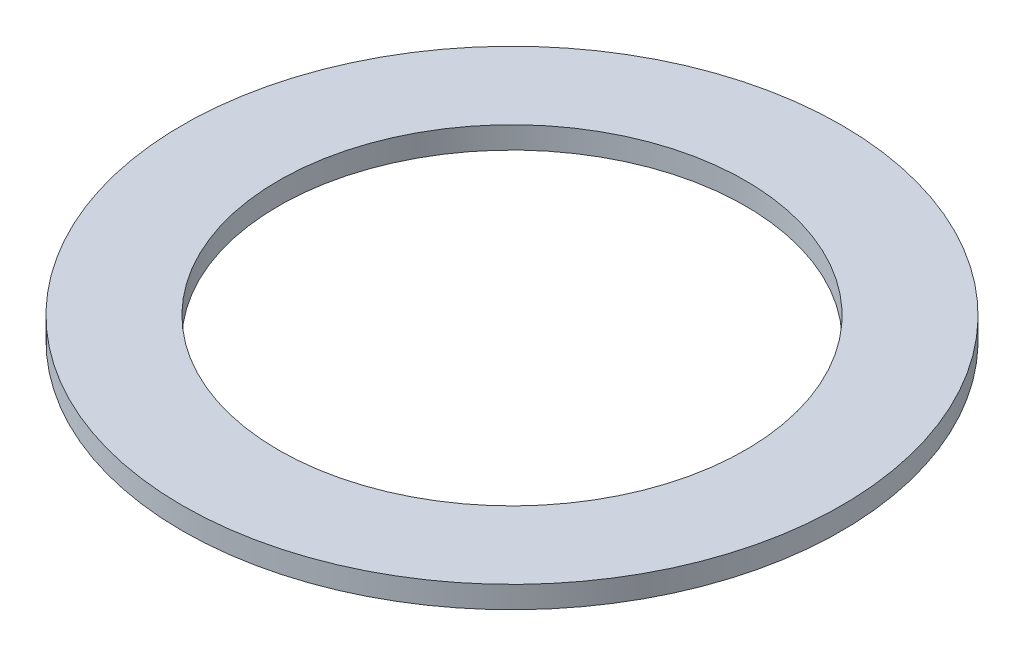
ISO-10303-21;
HEADER;
FILE_DESCRIPTION(('STEP AP214'),'2;1');
FILE_NAME('part.step','',(''),(''),'','','');
FILE_SCHEMA(('AUTOMOTIVE_DESIGN { 1 0 10303 214 1 1 1 1 }'));
ENDSEC;
DATA;
#1=APPLICATION_CONTEXT('core data for automotive mechanical design processes');
#2=APPLICATION_PROTOCOL_DEFINITION('international standard','automotive_design',2000,#1);
#3=PRODUCT_CONTEXT('',#1,'mechanical');
#4=PRODUCT('Part','Part','',(#3));
#5=PRODUCT_RELATED_PRODUCT_CATEGORY('part','',(#4));
#6=PRODUCT_DEFINITION_FORMATION('','',#4);
#7=PRODUCT_DEFINITION_CONTEXT('part definition',#1,'design');
#8=PRODUCT_DEFINITION('design','',#6,#7);
#9=PRODUCT_DEFINITION_SHAPE('','',#8);
#10=(LENGTH_UNIT() NAMED_UNIT(*) SI_UNIT(.MILLI.,.METRE.));
#11=(NAMED_UNIT(*) PLANE_ANGLE_UNIT() SI_UNIT($,.RADIAN.));
#12=(NAMED_UNIT(*) SI_UNIT($,.STERADIAN.) SOLID_ANGLE_UNIT());
#13=UNCERTAINTY_MEASURE_WITH_UNIT(LENGTH_MEASURE(1.E-05),#10,'distance_accuracy_value','');
#14=(GEOMETRIC_REPRESENTATION_CONTEXT(3) GLOBAL_UNCERTAINTY_ASSIGNED_CONTEXT((#13)) GLOBAL_UNIT_ASSIGNED_CONTEXT((#10,
#11,#12)) REPRESENTATION_CONTEXT('',''));
#15=CARTESIAN_POINT('',(0.,0.,0.));
#16=DIRECTION('',(0.,0.,1.));
#17=DIRECTION('',(1.,0.,0.));
#18=AXIS2_PLACEMENT_3D('',#15,#16,#17);
#19=CARTESIAN_POINT('',(0.,4.,0.));
#20=DIRECTION('',(0.,-1.,0.));
#21=DIRECTION('',(0.,0.,-1.));
#22=AXIS2_PLACEMENT_3D('',#19,#20,#21);
#23=CYLINDRICAL_SURFACE('',#22,60.);
#24=CARTESIAN_POINT('',(0.,4.,0.));
#25=DIRECTION('',(0.,1.,0.));
#26=DIRECTION('',(0.,0.,1.));
#27=AXIS2_PLACEMENT_3D('',#24,#25,#26);
#28=CIRCLE('',#27,60.);
#29=CARTESIAN_POINT('',(0.,4.,60.));
#30=VERTEX_POINT('',#29);
#31=EDGE_CURVE('E10',#30,#30,#28,.T.);
#32=ORIENTED_EDGE('',*,*,#31,.F.);
#33=EDGE_LOOP('',(#32));
#34=FACE_BOUND('',#33,.T.);
#35=CARTESIAN_POINT('',(0.,0.,0.));
#36=DIRECTION('',(0.,1.,0.));
#37=DIRECTION('',(0.,0.,1.));
#38=AXIS2_PLACEMENT_3D('',#35,#36,#37);
#39=CIRCLE('',#38,60.);
#40=CARTESIAN_POINT('',(0.,0.,60.));
#41=VERTEX_POINT('',#40);
#42=EDGE_CURVE('E37',#41,#41,#39,.T.);
#43=ORIENTED_EDGE('',*,*,#42,.T.);
#44=EDGE_LOOP('',(#43));
#45=FACE_BOUND('',#44,.T.);
#46=ADVANCED_FACE('F40',(#34,#45),#23,.T.);
#47=CARTESIAN_POINT('',(0.,4.,0.));
#48=DIRECTION('',(0.,1.,0.));
#49=DIRECTION('',(0.,0.,1.));
#50=AXIS2_PLACEMENT_3D('',#47,#48,#49);
#51=PLANE('',#50);
#52=CARTESIAN_POINT('',(0.,4.,0.));
#53=DIRECTION('',(0.,1.,0.));
#54=DIRECTION('',(0.,0.,1.));
#55=AXIS2_PLACEMENT_3D('',#52,#53,#54);
#56=CIRCLE('',#55,42.5);
#57=CARTESIAN_POINT('',(0.,4.,42.5));
#58=VERTEX_POINT('',#57);
#59=EDGE_CURVE('E50',#58,#58,#56,.T.);
#60=ORIENTED_EDGE('',*,*,#59,.F.);
#61=EDGE_LOOP('',(#60));
#62=FACE_BOUND('',#61,.T.);
#63=ORIENTED_EDGE('',*,*,#31,.T.);
#64=EDGE_LOOP('',(#63));
#65=FACE_BOUND('',#64,.T.);
#66=ADVANCED_FACE('F59',(#62,#65),#51,.T.);
#67=CARTESIAN_POINT('',(0.,0.,0.));
#68=DIRECTION('',(0.,1.,0.));
#69=DIRECTION('',(0.,0.,1.));
#70=AXIS2_PLACEMENT_3D('',#67,#68,#69);
#71=PLANE('',#70);
#72=CARTESIAN_POINT('',(0.,0.,0.));
#73=DIRECTION('',(0.,1.,0.));
#74=DIRECTION('',(0.,0.,1.));
#75=AXIS2_PLACEMENT_3D('',#72,#73,#74);
#76=CIRCLE('',#75,42.5);
#77=CARTESIAN_POINT('',(0.,0.,42.5));
#78=VERTEX_POINT('',#77);
#79=EDGE_CURVE('E47',#78,#78,#76,.T.);
#80=ORIENTED_EDGE('',*,*,#79,.T.);
#81=EDGE_LOOP('',(#80));
#82=FACE_BOUND('',#81,.T.);
#83=ORIENTED_EDGE('',*,*,#42,.F.);
#84=EDGE_LOOP('',(#83));
#85=FACE_BOUND('',#84,.T.);
#86=ADVANCED_FACE('F58',(#82,#85),#71,.F.);
#87=CARTESIAN_POINT('',(0.,4.,0.));
#88=DIRECTION('',(0.,-1.,0.));
#89=DIRECTION('',(0.,0.,-1.));
#90=AXIS2_PLACEMENT_3D('',#87,#88,#89);
#91=CYLINDRICAL_SURFACE('',#90,42.5);
#92=ORIENTED_EDGE('',*,*,#59,.T.);
#93=EDGE_LOOP('',(#92));
#94=FACE_BOUND('',#93,.T.);
#95=ORIENTED_EDGE('',*,*,#79,.F.);
#96=EDGE_LOOP('',(#95));
#97=FACE_BOUND('',#96,.T.);
#98=ADVANCED_FACE('F54',(#94,#97),#91,.F.);
#99=CLOSED_SHELL('',(#46,#66,#86,#98));
#100=MANIFOLD_SOLID_BREP('B2',#99);
#101=ADVANCED_BREP_SHAPE_REPRESENTATION('',(#18,#100),#14);
#102=SHAPE_DEFINITION_REPRESENTATION(#9,#101);
ENDSEC;
END-ISO-10303-21;
